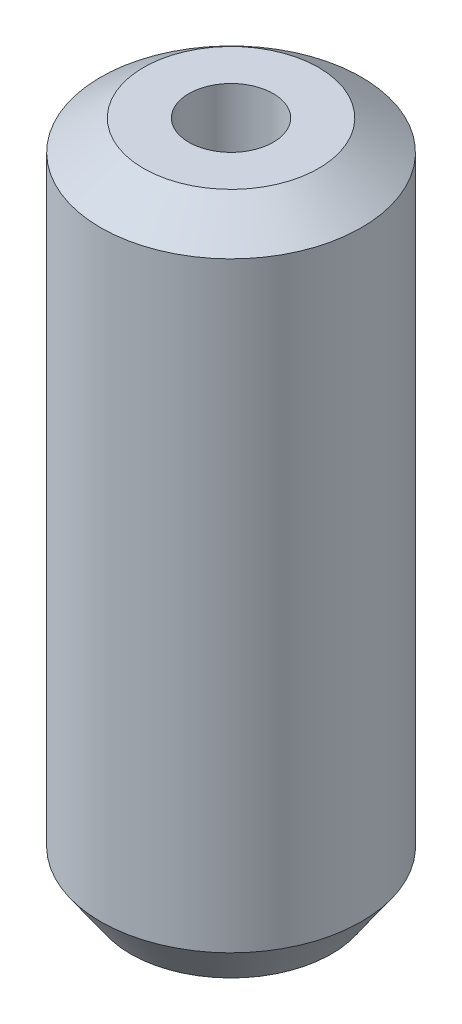
ISO-10303-21;
HEADER;
FILE_DESCRIPTION(('STEP AP214'),'2;1');
FILE_NAME('part.step','',(''),(''),'','','');
FILE_SCHEMA(('AUTOMOTIVE_DESIGN { 1 0 10303 214 1 1 1 1 }'));
ENDSEC;
DATA;
#1=APPLICATION_CONTEXT('core data for automotive mechanical design processes');
#2=APPLICATION_PROTOCOL_DEFINITION('international standard','automotive_design',2000,#1);
#3=PRODUCT_CONTEXT('',#1,'mechanical');
#4=PRODUCT('Part','Part','',(#3));
#5=PRODUCT_RELATED_PRODUCT_CATEGORY('part','',(#4));
#6=PRODUCT_DEFINITION_FORMATION('','',#4);
#7=PRODUCT_DEFINITION_CONTEXT('part definition',#1,'design');
#8=PRODUCT_DEFINITION('design','',#6,#7);
#9=PRODUCT_DEFINITION_SHAPE('','',#8);
#10=(LENGTH_UNIT() NAMED_UNIT(*) SI_UNIT(.MILLI.,.METRE.));
#11=(NAMED_UNIT(*) PLANE_ANGLE_UNIT() SI_UNIT($,.RADIAN.));
#12=(NAMED_UNIT(*) SI_UNIT($,.STERADIAN.) SOLID_ANGLE_UNIT());
#13=UNCERTAINTY_MEASURE_WITH_UNIT(LENGTH_MEASURE(1.E-05),#10,'distance_accuracy_value','');
#14=(GEOMETRIC_REPRESENTATION_CONTEXT(3) GLOBAL_UNCERTAINTY_ASSIGNED_CONTEXT((#13)) GLOBAL_UNIT_ASSIGNED_CONTEXT((#10,
#11,#12)) REPRESENTATION_CONTEXT('',''));
#15=CARTESIAN_POINT('',(0.,0.,0.));
#16=DIRECTION('',(0.,0.,1.));
#17=DIRECTION('',(1.,0.,0.));
#18=AXIS2_PLACEMENT_3D('',#15,#16,#17);
#19=CARTESIAN_POINT('',(0.,38.749428217705,0.));
#20=DIRECTION('',(0.,-1.,0.));
#21=DIRECTION('',(0.,0.,-1.));
#22=AXIS2_PLACEMENT_3D('',#19,#20,#21);
#23=CYLINDRICAL_SURFACE('',#22,7.5);
#24=CARTESIAN_POINT('',(0.,37.0326320631599,0.));
#25=DIRECTION('',(0.,1.,0.));
#26=DIRECTION('',(0.,0.,1.));
#27=AXIS2_PLACEMENT_3D('',#24,#25,#26);
#28=CIRCLE('',#27,7.5);
#29=CARTESIAN_POINT('',(0.,37.0326320631599,7.5));
#30=VERTEX_POINT('',#29);
#31=EDGE_CURVE('E50',#30,#30,#28,.F.);
#32=ORIENTED_EDGE('',*,*,#31,.T.);
#33=EDGE_LOOP('',(#32));
#34=FACE_BOUND('',#33,.T.);
#35=CARTESIAN_POINT('',(0.,2.46596880249256,0.));
#36=DIRECTION('',(0.,1.,0.));
#37=DIRECTION('',(0.,0.,1.));
#38=AXIS2_PLACEMENT_3D('',#35,#36,#37);
#39=CIRCLE('',#38,7.5);
#40=CARTESIAN_POINT('',(0.,2.46596880249256,7.5));
#41=VERTEX_POINT('',#40);
#42=EDGE_CURVE('E51',#41,#41,#39,.T.);
#43=ORIENTED_EDGE('',*,*,#42,.T.);
#44=EDGE_LOOP('',(#43));
#45=FACE_BOUND('',#44,.T.);
#46=ADVANCED_FACE('F39',(#34,#45),#23,.T.);
#47=CARTESIAN_POINT('',(0.,38.749428217705,0.));
#48=DIRECTION('',(0.,1.,0.));
#49=DIRECTION('',(0.,0.,1.));
#50=AXIS2_PLACEMENT_3D('',#47,#48,#49);
#51=PLANE('',#50);
#52=CARTESIAN_POINT('',(0.,38.749428217705,0.));
#53=DIRECTION('',(0.,1.,0.));
#54=DIRECTION('',(0.,0.,1.));
#55=AXIS2_PLACEMENT_3D('',#52,#53,#54);
#56=CIRCLE('',#55,5.03403119750744);
#57=CARTESIAN_POINT('',(0.,38.749428217705,5.03403119750744));
#58=VERTEX_POINT('',#57);
#59=EDGE_CURVE('E54',#58,#58,#56,.T.);
#60=ORIENTED_EDGE('',*,*,#59,.T.);
#61=EDGE_LOOP('',(#60));
#62=FACE_BOUND('',#61,.T.);
#63=CARTESIAN_POINT('',(0.,38.749428217705,0.));
#64=DIRECTION('',(0.,1.,0.));
#65=DIRECTION('',(0.,0.,1.));
#66=AXIS2_PLACEMENT_3D('',#63,#64,#65);
#67=CIRCLE('',#66,2.42753676570007);
#68=CARTESIAN_POINT('',(0.,38.749428217705,2.42753676570007));
#69=VERTEX_POINT('',#68);
#70=EDGE_CURVE('E58',#69,#69,#67,.T.);
#71=ORIENTED_EDGE('',*,*,#70,.F.);
#72=EDGE_LOOP('',(#71));
#73=FACE_BOUND('',#72,.T.);
#74=ADVANCED_FACE('F69',(#62,#73),#51,.T.);
#75=CARTESIAN_POINT('',(0.,0.,0.));
#76=DIRECTION('',(0.,1.,0.));
#77=DIRECTION('',(0.,0.,1.));
#78=AXIS2_PLACEMENT_3D('',#75,#76,#77);
#79=PLANE('',#78);
#80=CARTESIAN_POINT('',(0.,0.,0.));
#81=DIRECTION('',(0.,1.,0.));
#82=DIRECTION('',(0.,0.,1.));
#83=AXIS2_PLACEMENT_3D('',#80,#81,#82);
#84=CIRCLE('',#83,5.78320384545496);
#85=CARTESIAN_POINT('',(0.,0.,5.78320384545496));
#86=VERTEX_POINT('',#85);
#87=EDGE_CURVE('E10',#86,#86,#84,.F.);
#88=ORIENTED_EDGE('',*,*,#87,.T.);
#89=EDGE_LOOP('',(#88));
#90=FACE_BOUND('',#89,.T.);
#91=CARTESIAN_POINT('',(0.,0.,0.));
#92=DIRECTION('',(0.,1.,0.));
#93=DIRECTION('',(0.,0.,1.));
#94=AXIS2_PLACEMENT_3D('',#91,#92,#93);
#95=CIRCLE('',#94,2.42753676570007);
#96=CARTESIAN_POINT('',(0.,0.,2.42753676570007));
#97=VERTEX_POINT('',#96);
#98=EDGE_CURVE('E63',#97,#97,#95,.T.);
#99=ORIENTED_EDGE('',*,*,#98,.T.);
#100=EDGE_LOOP('',(#99));
#101=FACE_BOUND('',#100,.T.);
#102=ADVANCED_FACE('F75',(#90,#101),#79,.F.);
#103=CARTESIAN_POINT('',(0.,38.749428217705,0.));
#104=DIRECTION('',(0.,-1.,0.));
#105=DIRECTION('',(0.,0.,-1.));
#106=AXIS2_PLACEMENT_3D('',#103,#104,#105);
#107=CYLINDRICAL_SURFACE('',#106,2.42753676570007);
#108=ORIENTED_EDGE('',*,*,#70,.T.);
#109=EDGE_LOOP('',(#108));
#110=FACE_BOUND('',#109,.T.);
#111=ORIENTED_EDGE('',*,*,#98,.F.);
#112=EDGE_LOOP('',(#111));
#113=FACE_BOUND('',#112,.T.);
#114=ADVANCED_FACE('F70',(#110,#113),#107,.F.);
#115=CARTESIAN_POINT('',(0.,38.749428217705,0.));
#116=DIRECTION('',(0.,-1.,0.));
#117=DIRECTION('',(0.,0.,-1.));
#118=AXIS2_PLACEMENT_3D('',#115,#116,#117);
#119=CONICAL_SURFACE('',#118,5.03403119750744,0.962628346958951);
#120=ORIENTED_EDGE('',*,*,#31,.F.);
#121=EDGE_LOOP('',(#120));
#122=FACE_BOUND('',#121,.T.);
#123=ORIENTED_EDGE('',*,*,#59,.F.);
#124=EDGE_LOOP('',(#123));
#125=FACE_BOUND('',#124,.T.);
#126=ADVANCED_FACE('F81',(#122,#125),#119,.T.);
#127=CARTESIAN_POINT('',(0.,2.46596880249256,0.));
#128=DIRECTION('',(0.,1.,0.));
#129=DIRECTION('',(0.,0.,1.));
#130=AXIS2_PLACEMENT_3D('',#127,#128,#129);
#131=CONICAL_SURFACE('',#130,7.5,0.608167979835947);
#132=CARTESIAN_POINT('',(0.,0.,5.78320384545496));
#133=CARTESIAN_POINT('',(0.,0.0256871750259641,5.80108713873147));
#134=CARTESIAN_POINT('',(0.,0.0513743500519283,5.81897043200798));
#135=CARTESIAN_POINT('',(0.,0.102748700103857,5.854737018561));
#136=CARTESIAN_POINT('',(0.,0.128435875129821,5.87262031183751));
#137=CARTESIAN_POINT('',(0.,0.179810225181749,5.90838689839054));
#138=CARTESIAN_POINT('',(0.,0.205497400207713,5.92627019166705));
#139=CARTESIAN_POINT('',(0.,0.256871750259642,5.96203677822007));
#140=CARTESIAN_POINT('',(0.,0.282558925285606,5.97992007149658));
#141=CARTESIAN_POINT('',(0.,0.333933275337534,6.0156866580496));
#142=CARTESIAN_POINT('',(0.,0.359620450363499,6.03356995132611));
#143=CARTESIAN_POINT('',(0.,0.410994800415427,6.06933653787913));
#144=CARTESIAN_POINT('',(0.,0.436681975441391,6.08721983115564));
#145=CARTESIAN_POINT('',(0.,0.48805632549332,6.12298641770867));
#146=CARTESIAN_POINT('',(0.,0.513743500519284,6.14086971098518));
#147=CARTESIAN_POINT('',(0.,0.565117850571212,6.1766362975382));
#148=CARTESIAN_POINT('',(0.,0.590805025597177,6.19451959081471));
#149=CARTESIAN_POINT('',(0.,0.642179375649105,6.23028617736773));
#150=CARTESIAN_POINT('',(0.,0.667866550675069,6.24816947064424));
#151=CARTESIAN_POINT('',(0.,0.719240900726997,6.28393605719726));
#152=CARTESIAN_POINT('',(0.,0.744928075752962,6.30181935047377));
#153=CARTESIAN_POINT('',(0.,0.79630242580489,6.3375859370268));
#154=CARTESIAN_POINT('',(0.,0.821989600830854,6.35546923030331));
#155=CARTESIAN_POINT('',(0.,0.873363950882783,6.39123581685633));
#156=CARTESIAN_POINT('',(0.,0.899051125908747,6.40911911013284));
#157=CARTESIAN_POINT('',(0.,0.950425475960676,6.44488569668586));
#158=CARTESIAN_POINT('',(0.,0.97611265098664,6.46276898996237));
#159=CARTESIAN_POINT('',(0.,1.02748700103857,6.49853557651539));
#160=CARTESIAN_POINT('',(0.,1.05317417606453,6.5164188697919));
#161=CARTESIAN_POINT('',(0.,1.10454852611646,6.55218545634493));
#162=CARTESIAN_POINT('',(0.,1.13023570114243,6.57006874962144));
#163=CARTESIAN_POINT('',(0.,1.18161005119435,6.60583533617446));
#164=CARTESIAN_POINT('',(0.,1.20729722622032,6.62371862945097));
#165=CARTESIAN_POINT('',(0.,1.25867157627225,6.65948521600399));
#166=CARTESIAN_POINT('',(0.,1.28435875129821,6.6773685092805));
#167=CARTESIAN_POINT('',(0.,1.33573310135014,6.71313509583352));
#168=CARTESIAN_POINT('',(0.,1.3614202763761,6.73101838911003));
#169=CARTESIAN_POINT('',(0.,1.41279462642803,6.76678497566306));
#170=CARTESIAN_POINT('',(0.,1.438481801454,6.78466826893957));
#171=CARTESIAN_POINT('',(0.,1.48985615150592,6.82043485549259));
#172=CARTESIAN_POINT('',(0.,1.51554332653189,6.8383181487691));
#173=CARTESIAN_POINT('',(0.,1.56691767658382,6.87408473532212));
#174=CARTESIAN_POINT('',(0.,1.59260485160978,6.89196802859863));
#175=CARTESIAN_POINT('',(0.,1.64397920166171,6.92773461515165));
#176=CARTESIAN_POINT('',(0.,1.66966637668767,6.94561790842816));
#177=CARTESIAN_POINT('',(0.,1.7210407267396,6.98138449498119));
#178=CARTESIAN_POINT('',(0.,1.74672790176557,6.9992677882577));
#179=CARTESIAN_POINT('',(0.,1.79810225181749,7.03503437481072));
#180=CARTESIAN_POINT('',(0.,1.82378942684346,7.05291766808723));
#181=CARTESIAN_POINT('',(0.,1.87516377689539,7.08868425464025));
#182=CARTESIAN_POINT('',(0.,1.90085095192135,7.10656754791676));
#183=CARTESIAN_POINT('',(0.,1.95222530197328,7.14233413446978));
#184=CARTESIAN_POINT('',(0.,1.97791247699924,7.16021742774629));
#185=CARTESIAN_POINT('',(0.,2.02928682705117,7.19598401429931));
#186=CARTESIAN_POINT('',(0.,2.05497400207714,7.21386730757583));
#187=CARTESIAN_POINT('',(0.,2.10634835212907,7.24963389412885));
#188=CARTESIAN_POINT('',(0.,2.13203552715503,7.26751718740536));
#189=CARTESIAN_POINT('',(0.,2.18340987720696,7.30328377395838));
#190=CARTESIAN_POINT('',(0.,2.20909705223292,7.32116706723489));
#191=CARTESIAN_POINT('',(0.,2.26047140228485,7.35693365378791));
#192=CARTESIAN_POINT('',(0.,2.28615857731082,7.37481694706442));
#193=CARTESIAN_POINT('',(0.,2.33753292736274,7.41058353361745));
#194=CARTESIAN_POINT('',(0.,2.36322010238871,7.42846682689396));
#195=CARTESIAN_POINT('',(0.,2.41459445244064,7.46423341344698));
#196=CARTESIAN_POINT('',(0.,2.4402816274666,7.48211670672349));
#197=CARTESIAN_POINT('',(0.,2.46596880249256,7.5));
#198=B_SPLINE_CURVE_WITH_KNOTS('',3,(#132,#133,#134,#135,#136,#137,#138,#139,#140,#141,#142,
#143,#144,#145,#146,#147,#148,#149,#150,#151,#152,#153,#154,#155,#156,#157,#158,#159,#160,#161,
#162,#163,#164,#165,#166,#167,#168,#169,#170,#171,#172,#173,#174,#175,#176,#177,#178,#179,#180,
#181,#182,#183,#184,#185,#186,#187,#188,#189,#190,#191,#192,#193,#194,#195,#196,#197),
.UNSPECIFIED.,.F.,.F.,(4,2,2,2,2,2,2,2,2,2,2,2,2,2,2,2,2,2,2,2,2,2,2,2,2,2,2,2,2,2,2,2,4),(0.,
0.0938977542492576,0.187795508498515,0.281693262747773,0.37559101699703,0.469488771246288,
0.563386525495545,0.657284279744802,0.75118203399406,0.845079788243318,0.938977542492575,
1.03287529674183,1.12677305099109,1.22067080524035,1.3145685594896,1.40846631373886,
1.50236406798812,1.59626182223738,1.69015957648664,1.78405733073589,1.87795508498515,
1.97185283923441,2.06575059348366,2.15964834773292,2.25354610198218,2.34744385623144,
2.44134161048069,2.53523936472995,2.62913711897921,2.72303487322847,2.81693262747772,
2.91083038172698,3.00472813597624),.UNSPECIFIED.);
#199=EDGE_CURVE('BSEAM45',#86,#41,#198,.T.);
#200=ORIENTED_EDGE('',*,*,#87,.F.);
#201=ORIENTED_EDGE('',*,*,#42,.F.);
#202=ORIENTED_EDGE('',*,*,#199,.T.);
#203=ORIENTED_EDGE('',*,*,#199,.F.);
#204=EDGE_LOOP('',(#200,#202,#201,#203));
#205=FACE_BOUND('',#204,.T.);
#206=ADVANCED_FACE('F45',(#205),#131,.T.);
#207=CLOSED_SHELL('',(#46,#74,#102,#114,#126,#206));
#208=MANIFOLD_SOLID_BREP('B2',#207);
#209=ADVANCED_BREP_SHAPE_REPRESENTATION('',(#18,#208),#14);
#210=SHAPE_DEFINITION_REPRESENTATION(#9,#209);
ENDSEC;
END-ISO-10303-21;
